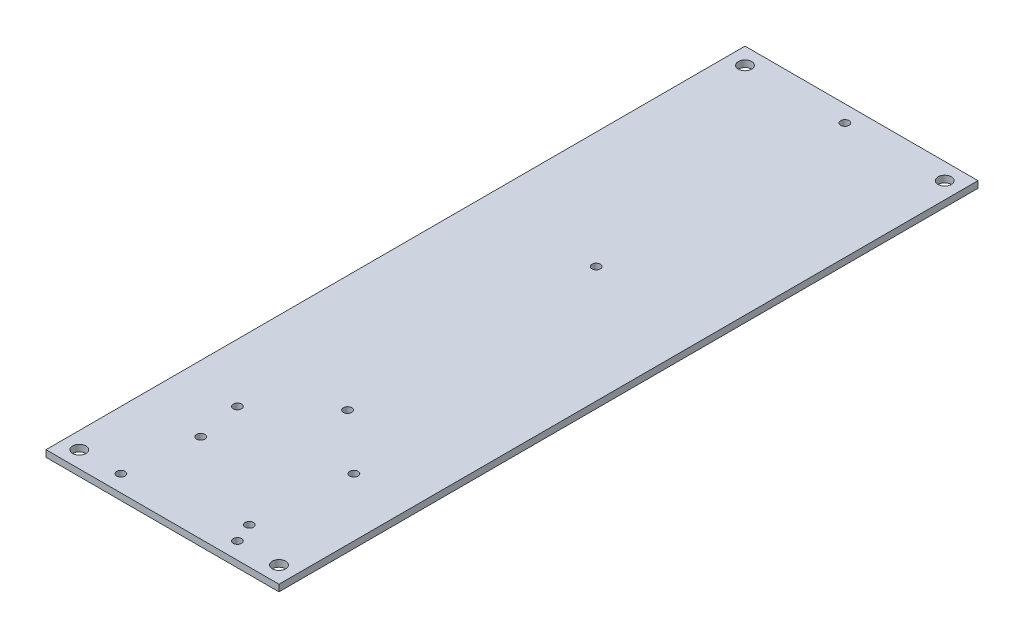
ISO-10303-21;
HEADER;
FILE_DESCRIPTION(('STEP AP214'),'2;1');
FILE_NAME('part.step','',(''),(''),'','','');
FILE_SCHEMA(('AUTOMOTIVE_DESIGN { 1 0 10303 214 1 1 1 1 }'));
ENDSEC;
DATA;
#1=APPLICATION_CONTEXT('core data for automotive mechanical design processes');
#2=APPLICATION_PROTOCOL_DEFINITION('international standard','automotive_design',2000,#1);
#3=PRODUCT_CONTEXT('',#1,'mechanical');
#4=PRODUCT('Part','Part','',(#3));
#5=PRODUCT_RELATED_PRODUCT_CATEGORY('part','',(#4));
#6=PRODUCT_DEFINITION_FORMATION('','',#4);
#7=PRODUCT_DEFINITION_CONTEXT('part definition',#1,'design');
#8=PRODUCT_DEFINITION('design','',#6,#7);
#9=PRODUCT_DEFINITION_SHAPE('','',#8);
#10=(LENGTH_UNIT() NAMED_UNIT(*) SI_UNIT(.MILLI.,.METRE.));
#11=(NAMED_UNIT(*) PLANE_ANGLE_UNIT() SI_UNIT($,.RADIAN.));
#12=(NAMED_UNIT(*) SI_UNIT($,.STERADIAN.) SOLID_ANGLE_UNIT());
#13=UNCERTAINTY_MEASURE_WITH_UNIT(LENGTH_MEASURE(1.E-05),#10,'distance_accuracy_value','');
#14=(GEOMETRIC_REPRESENTATION_CONTEXT(3) GLOBAL_UNCERTAINTY_ASSIGNED_CONTEXT((#13)) GLOBAL_UNIT_ASSIGNED_CONTEXT((#10,
#11,#12)) REPRESENTATION_CONTEXT('',''));
#15=CARTESIAN_POINT('',(0.,0.,0.));
#16=DIRECTION('',(0.,0.,1.));
#17=DIRECTION('',(1.,0.,0.));
#18=AXIS2_PLACEMENT_3D('',#15,#16,#17);
#19=CARTESIAN_POINT('',(0.,2.,0.));
#20=DIRECTION('',(1.,0.,0.));
#21=DIRECTION('',(0.,0.,-1.));
#22=AXIS2_PLACEMENT_3D('',#19,#20,#21);
#23=PLANE('',#22);
#24=DIRECTION('',(0.,0.,1.));
#25=VECTOR('',#24,1.);
#26=CARTESIAN_POINT('',(0.,0.,0.));
#27=LINE('',#26,#25);
#28=CARTESIAN_POINT('',(0.,0.,-210.));
#29=VERTEX_POINT('',#28);
#30=CARTESIAN_POINT('',(0.,0.,0.));
#31=VERTEX_POINT('',#30);
#32=EDGE_CURVE('E98',#29,#31,#27,.T.);
#33=ORIENTED_EDGE('',*,*,#32,.T.);
#34=DIRECTION('',(0.,-1.,0.));
#35=VECTOR('',#34,1.);
#36=CARTESIAN_POINT('',(0.,2.,0.));
#37=LINE('',#36,#35);
#38=CARTESIAN_POINT('',(0.,2.,0.));
#39=VERTEX_POINT('',#38);
#40=EDGE_CURVE('E11',#39,#31,#37,.T.);
#41=ORIENTED_EDGE('',*,*,#40,.F.);
#42=DIRECTION('',(0.,0.,1.));
#43=VECTOR('',#42,1.);
#44=CARTESIAN_POINT('',(0.,2.,0.));
#45=LINE('',#44,#43);
#46=CARTESIAN_POINT('',(0.,2.,-210.));
#47=VERTEX_POINT('',#46);
#48=EDGE_CURVE('E86',#47,#39,#45,.T.);
#49=ORIENTED_EDGE('',*,*,#48,.F.);
#50=DIRECTION('',(0.,-1.,0.));
#51=VECTOR('',#50,1.);
#52=CARTESIAN_POINT('',(0.,2.,-210.));
#53=LINE('',#52,#51);
#54=EDGE_CURVE('E94',#47,#29,#53,.T.);
#55=ORIENTED_EDGE('',*,*,#54,.T.);
#56=EDGE_LOOP('',(#33,#41,#49,#55));
#57=FACE_BOUND('',#56,.T.);
#58=ADVANCED_FACE('F35',(#57),#23,.F.);
#59=CARTESIAN_POINT('',(0.,2.,0.));
#60=DIRECTION('',(0.,0.,-1.));
#61=DIRECTION('',(-1.,0.,0.));
#62=AXIS2_PLACEMENT_3D('',#59,#60,#61);
#63=PLANE('',#62);
#64=DIRECTION('',(1.,0.,0.));
#65=VECTOR('',#64,1.);
#66=CARTESIAN_POINT('',(0.,0.,0.));
#67=LINE('',#66,#65);
#68=CARTESIAN_POINT('',(70.,0.,0.));
#69=VERTEX_POINT('',#68);
#70=EDGE_CURVE('E90',#31,#69,#67,.T.);
#71=ORIENTED_EDGE('',*,*,#70,.T.);
#72=DIRECTION('',(0.,-1.,0.));
#73=VECTOR('',#72,1.);
#74=CARTESIAN_POINT('',(70.,2.,0.));
#75=LINE('',#74,#73);
#76=CARTESIAN_POINT('',(70.,2.,0.));
#77=VERTEX_POINT('',#76);
#78=EDGE_CURVE('E43',#77,#69,#75,.T.);
#79=ORIENTED_EDGE('',*,*,#78,.F.);
#80=DIRECTION('',(1.,0.,0.));
#81=VECTOR('',#80,1.);
#82=CARTESIAN_POINT('',(0.,2.,0.));
#83=LINE('',#82,#81);
#84=EDGE_CURVE('E81',#39,#77,#83,.T.);
#85=ORIENTED_EDGE('',*,*,#84,.F.);
#86=ORIENTED_EDGE('',*,*,#40,.T.);
#87=EDGE_LOOP('',(#71,#79,#85,#86));
#88=FACE_BOUND('',#87,.T.);
#89=ADVANCED_FACE('F89',(#88),#63,.F.);
#90=CARTESIAN_POINT('',(70.,2.,0.));
#91=DIRECTION('',(-1.,0.,0.));
#92=DIRECTION('',(0.,0.,1.));
#93=AXIS2_PLACEMENT_3D('',#90,#91,#92);
#94=PLANE('',#93);
#95=DIRECTION('',(0.,0.,-1.));
#96=VECTOR('',#95,1.);
#97=CARTESIAN_POINT('',(70.,0.,0.));
#98=LINE('',#97,#96);
#99=CARTESIAN_POINT('',(70.,0.,-210.));
#100=VERTEX_POINT('',#99);
#101=EDGE_CURVE('E68',#69,#100,#98,.T.);
#102=ORIENTED_EDGE('',*,*,#101,.T.);
#103=DIRECTION('',(0.,-1.,0.));
#104=VECTOR('',#103,1.);
#105=CARTESIAN_POINT('',(70.,2.,-210.));
#106=LINE('',#105,#104);
#107=CARTESIAN_POINT('',(70.,2.,-210.));
#108=VERTEX_POINT('',#107);
#109=EDGE_CURVE('E91',#108,#100,#106,.T.);
#110=ORIENTED_EDGE('',*,*,#109,.F.);
#111=DIRECTION('',(0.,0.,-1.));
#112=VECTOR('',#111,1.);
#113=CARTESIAN_POINT('',(70.,2.,0.));
#114=LINE('',#113,#112);
#115=EDGE_CURVE('E84',#77,#108,#114,.T.);
#116=ORIENTED_EDGE('',*,*,#115,.F.);
#117=ORIENTED_EDGE('',*,*,#78,.T.);
#118=EDGE_LOOP('',(#102,#110,#116,#117));
#119=FACE_BOUND('',#118,.T.);
#120=ADVANCED_FACE('F92',(#119),#94,.F.);
#121=CARTESIAN_POINT('',(0.,2.,-210.));
#122=DIRECTION('',(0.,0.,1.));
#123=DIRECTION('',(1.,0.,0.));
#124=AXIS2_PLACEMENT_3D('',#121,#122,#123);
#125=PLANE('',#124);
#126=DIRECTION('',(-1.,0.,0.));
#127=VECTOR('',#126,1.);
#128=CARTESIAN_POINT('',(0.,0.,-210.));
#129=LINE('',#128,#127);
#130=EDGE_CURVE('E74',#100,#29,#129,.T.);
#131=ORIENTED_EDGE('',*,*,#130,.T.);
#132=ORIENTED_EDGE('',*,*,#54,.F.);
#133=DIRECTION('',(-1.,0.,0.));
#134=VECTOR('',#133,1.);
#135=CARTESIAN_POINT('',(0.,2.,-210.));
#136=LINE('',#135,#134);
#137=EDGE_CURVE('E51',#108,#47,#136,.T.);
#138=ORIENTED_EDGE('',*,*,#137,.F.);
#139=ORIENTED_EDGE('',*,*,#109,.T.);
#140=EDGE_LOOP('',(#131,#132,#138,#139));
#141=FACE_BOUND('',#140,.T.);
#142=ADVANCED_FACE('F106',(#141),#125,.F.);
#143=CARTESIAN_POINT('',(0.,2.,0.));
#144=DIRECTION('',(0.,-1.,0.));
#145=DIRECTION('',(0.,0.,-1.));
#146=AXIS2_PLACEMENT_3D('',#143,#144,#145);
#147=PLANE('',#146);
#148=CARTESIAN_POINT('',(19.9,2.,-26.6));
#149=DIRECTION('',(0.,1.,0.));
#150=DIRECTION('',(0.,0.,1.));
#151=AXIS2_PLACEMENT_3D('',#148,#149,#150);
#152=CIRCLE('',#151,1.24999999999999);
#153=CARTESIAN_POINT('',(19.9,2.,-25.35));
#154=VERTEX_POINT('',#153);
#155=EDGE_CURVE('E186',#154,#154,#152,.T.);
#156=ORIENTED_EDGE('',*,*,#155,.F.);
#157=EDGE_LOOP('',(#156));
#158=FACE_BOUND('',#157,.T.);
#159=CARTESIAN_POINT('',(50.1,2.,-11.));
#160=DIRECTION('',(0.,1.,0.));
#161=DIRECTION('',(0.,0.,1.));
#162=AXIS2_PLACEMENT_3D('',#159,#160,#161);
#163=CIRCLE('',#162,1.24999999999999);
#164=CARTESIAN_POINT('',(50.1,2.,-9.75000000000002));
#165=VERTEX_POINT('',#164);
#166=EDGE_CURVE('E180',#165,#165,#163,.T.);
#167=ORIENTED_EDGE('',*,*,#166,.F.);
#168=EDGE_LOOP('',(#167));
#169=FACE_BOUND('',#168,.T.);
#170=CARTESIAN_POINT('',(52.5,2.,-5.));
#171=DIRECTION('',(0.,1.,0.));
#172=DIRECTION('',(0.,0.,1.));
#173=AXIS2_PLACEMENT_3D('',#170,#171,#172);
#174=CIRCLE('',#173,1.24999999999999);
#175=CARTESIAN_POINT('',(52.5,2.,-3.75000000000001));
#176=VERTEX_POINT('',#175);
#177=EDGE_CURVE('E174',#176,#176,#174,.T.);
#178=ORIENTED_EDGE('',*,*,#177,.F.);
#179=EDGE_LOOP('',(#178));
#180=FACE_BOUND('',#179,.T.);
#181=CARTESIAN_POINT('',(17.5,2.,-5.));
#182=DIRECTION('',(0.,1.,0.));
#183=DIRECTION('',(0.,0.,1.));
#184=AXIS2_PLACEMENT_3D('',#181,#182,#183);
#185=CIRCLE('',#184,1.24999999999999);
#186=CARTESIAN_POINT('',(17.5,2.,-3.75000000000001));
#187=VERTEX_POINT('',#186);
#188=EDGE_CURVE('E168',#187,#187,#185,.T.);
#189=ORIENTED_EDGE('',*,*,#188,.F.);
#190=EDGE_LOOP('',(#189));
#191=FACE_BOUND('',#190,.T.);
#192=CARTESIAN_POINT('',(17.5,2.,-40.));
#193=DIRECTION('',(0.,1.,0.));
#194=DIRECTION('',(0.,0.,1.));
#195=AXIS2_PLACEMENT_3D('',#192,#193,#194);
#196=CIRCLE('',#195,1.24999999999999);
#197=CARTESIAN_POINT('',(17.5,2.,-38.75));
#198=VERTEX_POINT('',#197);
#199=EDGE_CURVE('E162',#198,#198,#196,.T.);
#200=ORIENTED_EDGE('',*,*,#199,.F.);
#201=EDGE_LOOP('',(#200));
#202=FACE_BOUND('',#201,.T.);
#203=CARTESIAN_POINT('',(52.5,2.,-40.));
#204=DIRECTION('',(0.,1.,0.));
#205=DIRECTION('',(0.,0.,1.));
#206=AXIS2_PLACEMENT_3D('',#203,#204,#205);
#207=CIRCLE('',#206,1.24999999999999);
#208=CARTESIAN_POINT('',(52.5,2.,-38.75));
#209=VERTEX_POINT('',#208);
#210=EDGE_CURVE('E156',#209,#209,#207,.T.);
#211=ORIENTED_EDGE('',*,*,#210,.F.);
#212=EDGE_LOOP('',(#211));
#213=FACE_BOUND('',#212,.T.);
#214=CARTESIAN_POINT('',(35.,2.,-205.));
#215=DIRECTION('',(0.,1.,0.));
#216=DIRECTION('',(0.,0.,1.));
#217=AXIS2_PLACEMENT_3D('',#214,#215,#216);
#218=CIRCLE('',#217,1.24999999999999);
#219=CARTESIAN_POINT('',(35.,2.,-203.75));
#220=VERTEX_POINT('',#219);
#221=EDGE_CURVE('E150',#220,#220,#218,.T.);
#222=ORIENTED_EDGE('',*,*,#221,.F.);
#223=EDGE_LOOP('',(#222));
#224=FACE_BOUND('',#223,.T.);
#225=CARTESIAN_POINT('',(35.,2.,-130.3));
#226=DIRECTION('',(0.,1.,0.));
#227=DIRECTION('',(0.,0.,1.));
#228=AXIS2_PLACEMENT_3D('',#225,#226,#227);
#229=CIRCLE('',#228,1.24999999999999);
#230=CARTESIAN_POINT('',(35.,2.,-129.05));
#231=VERTEX_POINT('',#230);
#232=EDGE_CURVE('E144',#231,#231,#229,.T.);
#233=ORIENTED_EDGE('',*,*,#232,.F.);
#234=EDGE_LOOP('',(#233));
#235=FACE_BOUND('',#234,.T.);
#236=CARTESIAN_POINT('',(35.,2.,-55.6));
#237=DIRECTION('',(0.,1.,0.));
#238=DIRECTION('',(0.,0.,1.));
#239=AXIS2_PLACEMENT_3D('',#236,#237,#238);
#240=CIRCLE('',#239,1.24999999999999);
#241=CARTESIAN_POINT('',(35.,2.,-54.35));
#242=VERTEX_POINT('',#241);
#243=EDGE_CURVE('E138',#242,#242,#240,.T.);
#244=ORIENTED_EDGE('',*,*,#243,.F.);
#245=EDGE_LOOP('',(#244));
#246=FACE_BOUND('',#245,.T.);
#247=CARTESIAN_POINT('',(65.,2.,-205.));
#248=DIRECTION('',(0.,1.,0.));
#249=DIRECTION('',(0.,0.,-1.));
#250=AXIS2_PLACEMENT_3D('',#247,#248,#249);
#251=CIRCLE('',#250,2.);
#252=CARTESIAN_POINT('',(65.,2.,-207.));
#253=VERTEX_POINT('',#252);
#254=EDGE_CURVE('E131',#253,#253,#251,.T.);
#255=ORIENTED_EDGE('',*,*,#254,.F.);
#256=EDGE_LOOP('',(#255));
#257=FACE_BOUND('',#256,.T.);
#258=CARTESIAN_POINT('',(65.,2.,-5.));
#259=DIRECTION('',(0.,1.,0.));
#260=DIRECTION('',(0.,0.,1.));
#261=AXIS2_PLACEMENT_3D('',#258,#259,#260);
#262=CIRCLE('',#261,2.);
#263=CARTESIAN_POINT('',(65.,2.,-3.00000000000001));
#264=VERTEX_POINT('',#263);
#265=EDGE_CURVE('E125',#264,#264,#262,.T.);
#266=ORIENTED_EDGE('',*,*,#265,.F.);
#267=EDGE_LOOP('',(#266));
#268=FACE_BOUND('',#267,.T.);
#269=CARTESIAN_POINT('',(5.00000000000005,2.,-5.));
#270=DIRECTION('',(0.,1.,0.));
#271=DIRECTION('',(0.,0.,-1.));
#272=AXIS2_PLACEMENT_3D('',#269,#270,#271);
#273=CIRCLE('',#272,2.);
#274=CARTESIAN_POINT('',(5.00000000000005,2.,-7.));
#275=VERTEX_POINT('',#274);
#276=EDGE_CURVE('E118',#275,#275,#273,.T.);
#277=ORIENTED_EDGE('',*,*,#276,.F.);
#278=EDGE_LOOP('',(#277));
#279=FACE_BOUND('',#278,.T.);
#280=CARTESIAN_POINT('',(5.,2.,-205.));
#281=DIRECTION('',(0.,1.,0.));
#282=DIRECTION('',(0.,0.,1.));
#283=AXIS2_PLACEMENT_3D('',#280,#281,#282);
#284=CIRCLE('',#283,2.);
#285=CARTESIAN_POINT('',(5.,2.,-203.));
#286=VERTEX_POINT('',#285);
#287=EDGE_CURVE('E112',#286,#286,#284,.T.);
#288=ORIENTED_EDGE('',*,*,#287,.F.);
#289=EDGE_LOOP('',(#288));
#290=FACE_BOUND('',#289,.T.);
#291=ORIENTED_EDGE('',*,*,#48,.T.);
#292=ORIENTED_EDGE('',*,*,#84,.T.);
#293=ORIENTED_EDGE('',*,*,#115,.T.);
#294=ORIENTED_EDGE('',*,*,#137,.T.);
#295=EDGE_LOOP('',(#291,#292,#293,#294));
#296=FACE_BOUND('',#295,.T.);
#297=ADVANCED_FACE('F82',(#158,#169,#180,#191,#202,#213,#224,#235,#246,#257,#268,#279,#290,
#296),#147,.F.);
#298=CARTESIAN_POINT('',(0.,0.,0.));
#299=DIRECTION('',(0.,-1.,0.));
#300=DIRECTION('',(0.,0.,-1.));
#301=AXIS2_PLACEMENT_3D('',#298,#299,#300);
#302=PLANE('',#301);
#303=CARTESIAN_POINT('',(19.9,0.,-26.6));
#304=DIRECTION('',(0.,1.,0.));
#305=DIRECTION('',(0.,0.,1.));
#306=AXIS2_PLACEMENT_3D('',#303,#304,#305);
#307=CIRCLE('',#306,1.25);
#308=CARTESIAN_POINT('',(19.9,0.,-25.35));
#309=VERTEX_POINT('',#308);
#310=EDGE_CURVE('E183',#309,#309,#307,.T.);
#311=ORIENTED_EDGE('',*,*,#310,.T.);
#312=EDGE_LOOP('',(#311));
#313=FACE_BOUND('',#312,.T.);
#314=CARTESIAN_POINT('',(50.1,0.,-11.));
#315=DIRECTION('',(0.,1.,0.));
#316=DIRECTION('',(0.,0.,1.));
#317=AXIS2_PLACEMENT_3D('',#314,#315,#316);
#318=CIRCLE('',#317,1.25);
#319=CARTESIAN_POINT('',(50.1,0.,-9.75));
#320=VERTEX_POINT('',#319);
#321=EDGE_CURVE('E177',#320,#320,#318,.T.);
#322=ORIENTED_EDGE('',*,*,#321,.T.);
#323=EDGE_LOOP('',(#322));
#324=FACE_BOUND('',#323,.T.);
#325=CARTESIAN_POINT('',(52.5,0.,-5.));
#326=DIRECTION('',(0.,1.,0.));
#327=DIRECTION('',(0.,0.,1.));
#328=AXIS2_PLACEMENT_3D('',#325,#326,#327);
#329=CIRCLE('',#328,1.25);
#330=CARTESIAN_POINT('',(52.5,0.,-3.75));
#331=VERTEX_POINT('',#330);
#332=EDGE_CURVE('E171',#331,#331,#329,.T.);
#333=ORIENTED_EDGE('',*,*,#332,.T.);
#334=EDGE_LOOP('',(#333));
#335=FACE_BOUND('',#334,.T.);
#336=CARTESIAN_POINT('',(17.5,0.,-5.));
#337=DIRECTION('',(0.,1.,0.));
#338=DIRECTION('',(0.,0.,1.));
#339=AXIS2_PLACEMENT_3D('',#336,#337,#338);
#340=CIRCLE('',#339,1.25);
#341=CARTESIAN_POINT('',(17.5,0.,-3.75));
#342=VERTEX_POINT('',#341);
#343=EDGE_CURVE('E165',#342,#342,#340,.T.);
#344=ORIENTED_EDGE('',*,*,#343,.T.);
#345=EDGE_LOOP('',(#344));
#346=FACE_BOUND('',#345,.T.);
#347=CARTESIAN_POINT('',(17.5,0.,-40.));
#348=DIRECTION('',(0.,1.,0.));
#349=DIRECTION('',(0.,0.,1.));
#350=AXIS2_PLACEMENT_3D('',#347,#348,#349);
#351=CIRCLE('',#350,1.25);
#352=CARTESIAN_POINT('',(17.5,0.,-38.75));
#353=VERTEX_POINT('',#352);
#354=EDGE_CURVE('E159',#353,#353,#351,.T.);
#355=ORIENTED_EDGE('',*,*,#354,.T.);
#356=EDGE_LOOP('',(#355));
#357=FACE_BOUND('',#356,.T.);
#358=CARTESIAN_POINT('',(52.5,0.,-40.));
#359=DIRECTION('',(0.,1.,0.));
#360=DIRECTION('',(0.,0.,1.));
#361=AXIS2_PLACEMENT_3D('',#358,#359,#360);
#362=CIRCLE('',#361,1.25);
#363=CARTESIAN_POINT('',(52.5,0.,-38.75));
#364=VERTEX_POINT('',#363);
#365=EDGE_CURVE('E153',#364,#364,#362,.T.);
#366=ORIENTED_EDGE('',*,*,#365,.T.);
#367=EDGE_LOOP('',(#366));
#368=FACE_BOUND('',#367,.T.);
#369=CARTESIAN_POINT('',(35.,0.,-205.));
#370=DIRECTION('',(0.,1.,0.));
#371=DIRECTION('',(0.,0.,1.));
#372=AXIS2_PLACEMENT_3D('',#369,#370,#371);
#373=CIRCLE('',#372,1.25);
#374=CARTESIAN_POINT('',(35.,0.,-203.75));
#375=VERTEX_POINT('',#374);
#376=EDGE_CURVE('E147',#375,#375,#373,.T.);
#377=ORIENTED_EDGE('',*,*,#376,.T.);
#378=EDGE_LOOP('',(#377));
#379=FACE_BOUND('',#378,.T.);
#380=CARTESIAN_POINT('',(35.,0.,-130.3));
#381=DIRECTION('',(0.,1.,0.));
#382=DIRECTION('',(0.,0.,1.));
#383=AXIS2_PLACEMENT_3D('',#380,#381,#382);
#384=CIRCLE('',#383,1.25);
#385=CARTESIAN_POINT('',(35.,0.,-129.05));
#386=VERTEX_POINT('',#385);
#387=EDGE_CURVE('E141',#386,#386,#384,.T.);
#388=ORIENTED_EDGE('',*,*,#387,.T.);
#389=EDGE_LOOP('',(#388));
#390=FACE_BOUND('',#389,.T.);
#391=CARTESIAN_POINT('',(35.,0.,-55.6));
#392=DIRECTION('',(0.,1.,0.));
#393=DIRECTION('',(0.,0.,1.));
#394=AXIS2_PLACEMENT_3D('',#391,#392,#393);
#395=CIRCLE('',#394,1.25);
#396=CARTESIAN_POINT('',(35.,0.,-54.35));
#397=VERTEX_POINT('',#396);
#398=EDGE_CURVE('E122',#397,#397,#395,.T.);
#399=ORIENTED_EDGE('',*,*,#398,.T.);
#400=EDGE_LOOP('',(#399));
#401=FACE_BOUND('',#400,.T.);
#402=CARTESIAN_POINT('',(65.,0.,-205.));
#403=DIRECTION('',(0.,1.,0.));
#404=DIRECTION('',(0.,0.,-1.));
#405=AXIS2_PLACEMENT_3D('',#402,#403,#404);
#406=CIRCLE('',#405,2.);
#407=CARTESIAN_POINT('',(65.,0.,-207.));
#408=VERTEX_POINT('',#407);
#409=EDGE_CURVE('E115',#408,#408,#406,.T.);
#410=ORIENTED_EDGE('',*,*,#409,.T.);
#411=EDGE_LOOP('',(#410));
#412=FACE_BOUND('',#411,.T.);
#413=CARTESIAN_POINT('',(65.,0.,-5.));
#414=DIRECTION('',(0.,1.,0.));
#415=DIRECTION('',(0.,0.,1.));
#416=AXIS2_PLACEMENT_3D('',#413,#414,#415);
#417=CIRCLE('',#416,2.);
#418=CARTESIAN_POINT('',(65.,0.,-3.00000000000001));
#419=VERTEX_POINT('',#418);
#420=EDGE_CURVE('E128',#419,#419,#417,.T.);
#421=ORIENTED_EDGE('',*,*,#420,.T.);
#422=EDGE_LOOP('',(#421));
#423=FACE_BOUND('',#422,.T.);
#424=CARTESIAN_POINT('',(5.00000000000005,0.,-5.));
#425=DIRECTION('',(0.,1.,0.));
#426=DIRECTION('',(0.,0.,-1.));
#427=AXIS2_PLACEMENT_3D('',#424,#425,#426);
#428=CIRCLE('',#427,2.);
#429=CARTESIAN_POINT('',(5.00000000000005,0.,-7.));
#430=VERTEX_POINT('',#429);
#431=EDGE_CURVE('E121',#430,#430,#428,.T.);
#432=ORIENTED_EDGE('',*,*,#431,.T.);
#433=EDGE_LOOP('',(#432));
#434=FACE_BOUND('',#433,.T.);
#435=CARTESIAN_POINT('',(5.,0.,-205.));
#436=DIRECTION('',(0.,1.,0.));
#437=DIRECTION('',(0.,0.,1.));
#438=AXIS2_PLACEMENT_3D('',#435,#436,#437);
#439=CIRCLE('',#438,2.);
#440=CARTESIAN_POINT('',(5.,0.,-203.));
#441=VERTEX_POINT('',#440);
#442=EDGE_CURVE('E101',#441,#441,#439,.T.);
#443=ORIENTED_EDGE('',*,*,#442,.T.);
#444=EDGE_LOOP('',(#443));
#445=FACE_BOUND('',#444,.T.);
#446=ORIENTED_EDGE('',*,*,#32,.F.);
#447=ORIENTED_EDGE('',*,*,#130,.F.);
#448=ORIENTED_EDGE('',*,*,#101,.F.);
#449=ORIENTED_EDGE('',*,*,#70,.F.);
#450=EDGE_LOOP('',(#446,#447,#448,#449));
#451=FACE_BOUND('',#450,.T.);
#452=ADVANCED_FACE('F109',(#313,#324,#335,#346,#357,#368,#379,#390,#401,#412,#423,#434,#445,
#451),#302,.T.);
#453=CARTESIAN_POINT('',(5.,0.,-205.));
#454=DIRECTION('',(0.,1.,0.));
#455=DIRECTION('',(0.,0.,1.));
#456=AXIS2_PLACEMENT_3D('',#453,#454,#455);
#457=CYLINDRICAL_SURFACE('',#456,2.);
#458=ORIENTED_EDGE('',*,*,#442,.F.);
#459=EDGE_LOOP('',(#458));
#460=FACE_BOUND('',#459,.T.);
#461=ORIENTED_EDGE('',*,*,#287,.T.);
#462=EDGE_LOOP('',(#461));
#463=FACE_BOUND('',#462,.T.);
#464=ADVANCED_FACE('F219',(#460,#463),#457,.F.);
#465=CARTESIAN_POINT('',(5.00000000000005,0.,-5.));
#466=DIRECTION('',(0.,1.,0.));
#467=DIRECTION('',(0.,0.,1.));
#468=AXIS2_PLACEMENT_3D('',#465,#466,#467);
#469=CYLINDRICAL_SURFACE('',#468,2.);
#470=ORIENTED_EDGE('',*,*,#431,.F.);
#471=EDGE_LOOP('',(#470));
#472=FACE_BOUND('',#471,.T.);
#473=ORIENTED_EDGE('',*,*,#276,.T.);
#474=EDGE_LOOP('',(#473));
#475=FACE_BOUND('',#474,.T.);
#476=ADVANCED_FACE('F221',(#472,#475),#469,.F.);
#477=CARTESIAN_POINT('',(65.,0.,-5.));
#478=DIRECTION('',(0.,1.,0.));
#479=DIRECTION('',(0.,0.,1.));
#480=AXIS2_PLACEMENT_3D('',#477,#478,#479);
#481=CYLINDRICAL_SURFACE('',#480,2.);
#482=ORIENTED_EDGE('',*,*,#420,.F.);
#483=EDGE_LOOP('',(#482));
#484=FACE_BOUND('',#483,.T.);
#485=ORIENTED_EDGE('',*,*,#265,.T.);
#486=EDGE_LOOP('',(#485));
#487=FACE_BOUND('',#486,.T.);
#488=ADVANCED_FACE('F228',(#484,#487),#481,.F.);
#489=CARTESIAN_POINT('',(65.,0.,-205.));
#490=DIRECTION('',(0.,1.,0.));
#491=DIRECTION('',(0.,0.,1.));
#492=AXIS2_PLACEMENT_3D('',#489,#490,#491);
#493=CYLINDRICAL_SURFACE('',#492,2.);
#494=ORIENTED_EDGE('',*,*,#409,.F.);
#495=EDGE_LOOP('',(#494));
#496=FACE_BOUND('',#495,.T.);
#497=ORIENTED_EDGE('',*,*,#254,.T.);
#498=EDGE_LOOP('',(#497));
#499=FACE_BOUND('',#498,.T.);
#500=ADVANCED_FACE('F311',(#496,#499),#493,.F.);
#501=CARTESIAN_POINT('',(35.,2.,-55.6));
#502=DIRECTION('',(0.,1.,0.));
#503=DIRECTION('',(0.,0.,1.));
#504=AXIS2_PLACEMENT_3D('',#501,#502,#503);
#505=CYLINDRICAL_SURFACE('',#504,1.24999999999999);
#506=ORIENTED_EDGE('',*,*,#398,.F.);
#507=EDGE_LOOP('',(#506));
#508=FACE_BOUND('',#507,.T.);
#509=ORIENTED_EDGE('',*,*,#243,.T.);
#510=EDGE_LOOP('',(#509));
#511=FACE_BOUND('',#510,.T.);
#512=ADVANCED_FACE('F307',(#508,#511),#505,.F.);
#513=CARTESIAN_POINT('',(35.,2.,-130.3));
#514=DIRECTION('',(0.,1.,0.));
#515=DIRECTION('',(0.,0.,1.));
#516=AXIS2_PLACEMENT_3D('',#513,#514,#515);
#517=CYLINDRICAL_SURFACE('',#516,1.24999999999999);
#518=ORIENTED_EDGE('',*,*,#387,.F.);
#519=EDGE_LOOP('',(#518));
#520=FACE_BOUND('',#519,.T.);
#521=ORIENTED_EDGE('',*,*,#232,.T.);
#522=EDGE_LOOP('',(#521));
#523=FACE_BOUND('',#522,.T.);
#524=ADVANCED_FACE('F303',(#520,#523),#517,.F.);
#525=CARTESIAN_POINT('',(35.,2.,-205.));
#526=DIRECTION('',(0.,1.,0.));
#527=DIRECTION('',(0.,0.,1.));
#528=AXIS2_PLACEMENT_3D('',#525,#526,#527);
#529=CYLINDRICAL_SURFACE('',#528,1.24999999999999);
#530=ORIENTED_EDGE('',*,*,#376,.F.);
#531=EDGE_LOOP('',(#530));
#532=FACE_BOUND('',#531,.T.);
#533=ORIENTED_EDGE('',*,*,#221,.T.);
#534=EDGE_LOOP('',(#533));
#535=FACE_BOUND('',#534,.T.);
#536=ADVANCED_FACE('F299',(#532,#535),#529,.F.);
#537=CARTESIAN_POINT('',(52.5,2.,-40.));
#538=DIRECTION('',(0.,1.,0.));
#539=DIRECTION('',(0.,0.,1.));
#540=AXIS2_PLACEMENT_3D('',#537,#538,#539);
#541=CYLINDRICAL_SURFACE('',#540,1.24999999999999);
#542=ORIENTED_EDGE('',*,*,#365,.F.);
#543=EDGE_LOOP('',(#542));
#544=FACE_BOUND('',#543,.T.);
#545=ORIENTED_EDGE('',*,*,#210,.T.);
#546=EDGE_LOOP('',(#545));
#547=FACE_BOUND('',#546,.T.);
#548=ADVANCED_FACE('F295',(#544,#547),#541,.F.);
#549=CARTESIAN_POINT('',(17.5,2.,-40.));
#550=DIRECTION('',(0.,1.,0.));
#551=DIRECTION('',(0.,0.,1.));
#552=AXIS2_PLACEMENT_3D('',#549,#550,#551);
#553=CYLINDRICAL_SURFACE('',#552,1.24999999999999);
#554=ORIENTED_EDGE('',*,*,#354,.F.);
#555=EDGE_LOOP('',(#554));
#556=FACE_BOUND('',#555,.T.);
#557=ORIENTED_EDGE('',*,*,#199,.T.);
#558=EDGE_LOOP('',(#557));
#559=FACE_BOUND('',#558,.T.);
#560=ADVANCED_FACE('F291',(#556,#559),#553,.F.);
#561=CARTESIAN_POINT('',(17.5,2.,-5.));
#562=DIRECTION('',(0.,1.,0.));
#563=DIRECTION('',(0.,0.,1.));
#564=AXIS2_PLACEMENT_3D('',#561,#562,#563);
#565=CYLINDRICAL_SURFACE('',#564,1.24999999999999);
#566=ORIENTED_EDGE('',*,*,#343,.F.);
#567=EDGE_LOOP('',(#566));
#568=FACE_BOUND('',#567,.T.);
#569=ORIENTED_EDGE('',*,*,#188,.T.);
#570=EDGE_LOOP('',(#569));
#571=FACE_BOUND('',#570,.T.);
#572=ADVANCED_FACE('F287',(#568,#571),#565,.F.);
#573=CARTESIAN_POINT('',(52.5,2.,-5.));
#574=DIRECTION('',(0.,1.,0.));
#575=DIRECTION('',(0.,0.,1.));
#576=AXIS2_PLACEMENT_3D('',#573,#574,#575);
#577=CYLINDRICAL_SURFACE('',#576,1.24999999999999);
#578=ORIENTED_EDGE('',*,*,#332,.F.);
#579=EDGE_LOOP('',(#578));
#580=FACE_BOUND('',#579,.T.);
#581=ORIENTED_EDGE('',*,*,#177,.T.);
#582=EDGE_LOOP('',(#581));
#583=FACE_BOUND('',#582,.T.);
#584=ADVANCED_FACE('F268',(#580,#583),#577,.F.);
#585=CARTESIAN_POINT('',(50.1,2.,-11.));
#586=DIRECTION('',(0.,1.,0.));
#587=DIRECTION('',(0.,0.,1.));
#588=AXIS2_PLACEMENT_3D('',#585,#586,#587);
#589=CYLINDRICAL_SURFACE('',#588,1.24999999999999);
#590=ORIENTED_EDGE('',*,*,#321,.F.);
#591=EDGE_LOOP('',(#590));
#592=FACE_BOUND('',#591,.T.);
#593=ORIENTED_EDGE('',*,*,#166,.T.);
#594=EDGE_LOOP('',(#593));
#595=FACE_BOUND('',#594,.T.);
#596=ADVANCED_FACE('F263',(#592,#595),#589,.F.);
#597=CARTESIAN_POINT('',(19.9,2.,-26.6));
#598=DIRECTION('',(0.,1.,0.));
#599=DIRECTION('',(0.,0.,1.));
#600=AXIS2_PLACEMENT_3D('',#597,#598,#599);
#601=CYLINDRICAL_SURFACE('',#600,1.24999999999999);
#602=ORIENTED_EDGE('',*,*,#310,.F.);
#603=EDGE_LOOP('',(#602));
#604=FACE_BOUND('',#603,.T.);
#605=ORIENTED_EDGE('',*,*,#155,.T.);
#606=EDGE_LOOP('',(#605));
#607=FACE_BOUND('',#606,.T.);
#608=ADVANCED_FACE('F190',(#604,#607),#601,.F.);
#609=CLOSED_SHELL('',(#58,#89,#120,#142,#297,#452,#464,#476,#488,#500,#512,#524,#536,#548,#560,
#572,#584,#596,#608));
#610=MANIFOLD_SOLID_BREP('B2',#609);
#611=ADVANCED_BREP_SHAPE_REPRESENTATION('',(#18,#610),#14);
#612=SHAPE_DEFINITION_REPRESENTATION(#9,#611);
ENDSEC;
END-ISO-10303-21;
